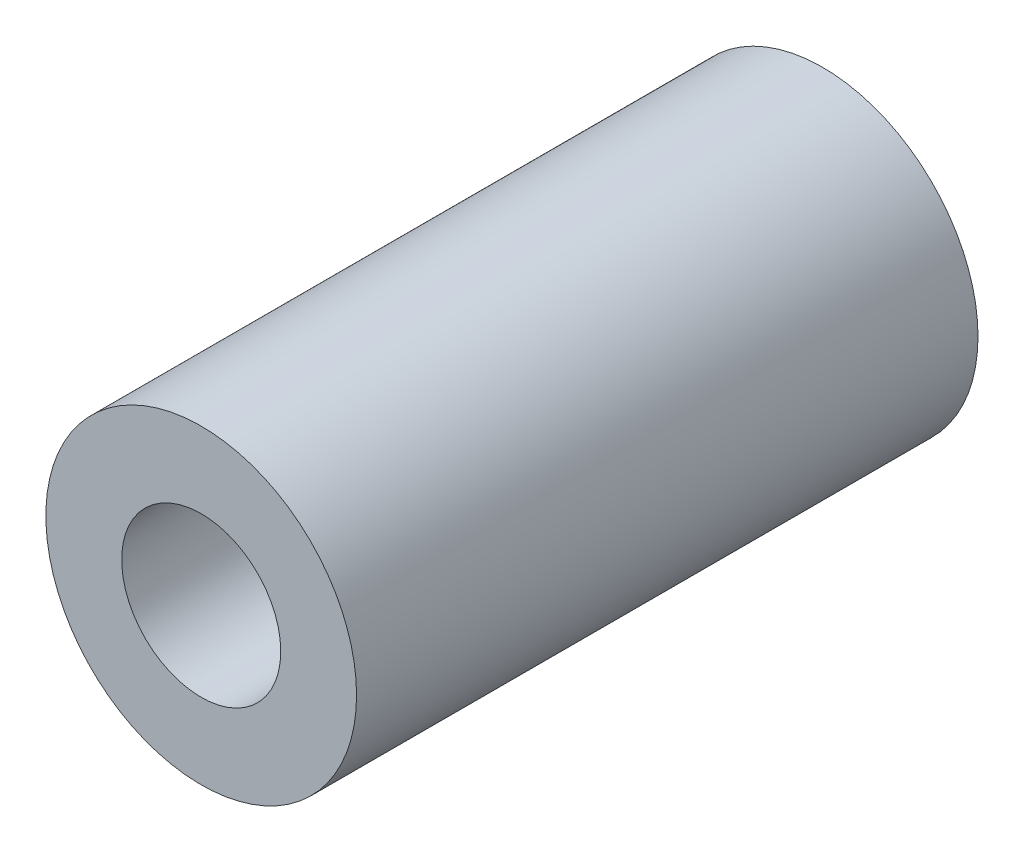
ISO-10303-21;
HEADER;
FILE_DESCRIPTION(('STEP AP214'),'2;1');
FILE_NAME('part.step','',(''),(''),'','','');
FILE_SCHEMA(('AUTOMOTIVE_DESIGN { 1 0 10303 214 1 1 1 1 }'));
ENDSEC;
DATA;
#1=APPLICATION_CONTEXT('core data for automotive mechanical design processes');
#2=APPLICATION_PROTOCOL_DEFINITION('international standard','automotive_design',2000,#1);
#3=PRODUCT_CONTEXT('',#1,'mechanical');
#4=PRODUCT('Part','Part','',(#3));
#5=PRODUCT_RELATED_PRODUCT_CATEGORY('part','',(#4));
#6=PRODUCT_DEFINITION_FORMATION('','',#4);
#7=PRODUCT_DEFINITION_CONTEXT('part definition',#1,'design');
#8=PRODUCT_DEFINITION('design','',#6,#7);
#9=PRODUCT_DEFINITION_SHAPE('','',#8);
#10=(LENGTH_UNIT() NAMED_UNIT(*) SI_UNIT(.MILLI.,.METRE.));
#11=(NAMED_UNIT(*) PLANE_ANGLE_UNIT() SI_UNIT($,.RADIAN.));
#12=(NAMED_UNIT(*) SI_UNIT($,.STERADIAN.) SOLID_ANGLE_UNIT());
#13=UNCERTAINTY_MEASURE_WITH_UNIT(LENGTH_MEASURE(1.E-05),#10,'distance_accuracy_value','');
#14=(GEOMETRIC_REPRESENTATION_CONTEXT(3) GLOBAL_UNCERTAINTY_ASSIGNED_CONTEXT((#13)) GLOBAL_UNIT_ASSIGNED_CONTEXT((#10,
#11,#12)) REPRESENTATION_CONTEXT('',''));
#15=CARTESIAN_POINT('',(0.,0.,0.));
#16=DIRECTION('',(0.,0.,1.));
#17=DIRECTION('',(1.,0.,0.));
#18=AXIS2_PLACEMENT_3D('',#15,#16,#17);
#19=CARTESIAN_POINT('',(0.,0.,9.525));
#20=DIRECTION('',(0.,0.,1.));
#21=DIRECTION('',(1.,0.,0.));
#22=AXIS2_PLACEMENT_3D('',#19,#20,#21);
#23=PLANE('',#22);
#24=CARTESIAN_POINT('',(0.,0.,9.525));
#25=DIRECTION('',(0.,0.,1.));
#26=DIRECTION('',(1.,0.,0.));
#27=AXIS2_PLACEMENT_3D('',#24,#25,#26);
#28=CIRCLE('',#27,4.7625);
#29=CARTESIAN_POINT('',(4.7625,0.,9.525));
#30=VERTEX_POINT('',#29);
#31=EDGE_CURVE('E10',#30,#30,#28,.T.);
#32=ORIENTED_EDGE('',*,*,#31,.T.);
#33=EDGE_LOOP('',(#32));
#34=FACE_BOUND('',#33,.T.);
#35=CARTESIAN_POINT('',(0.,0.,9.525));
#36=DIRECTION('',(0.,0.,1.));
#37=DIRECTION('',(1.,0.,0.));
#38=AXIS2_PLACEMENT_3D('',#35,#36,#37);
#39=CIRCLE('',#38,2.4384);
#40=CARTESIAN_POINT('',(2.4384,0.,9.525));
#41=VERTEX_POINT('',#40);
#42=EDGE_CURVE('E43',#41,#41,#39,.T.);
#43=ORIENTED_EDGE('',*,*,#42,.F.);
#44=EDGE_LOOP('',(#43));
#45=FACE_BOUND('',#44,.T.);
#46=ADVANCED_FACE('F32',(#34,#45),#23,.T.);
#47=CARTESIAN_POINT('',(0.,0.,-9.525));
#48=DIRECTION('',(0.,0.,1.));
#49=DIRECTION('',(1.,0.,0.));
#50=AXIS2_PLACEMENT_3D('',#47,#48,#49);
#51=PLANE('',#50);
#52=CARTESIAN_POINT('',(0.,0.,-9.525));
#53=DIRECTION('',(0.,0.,1.));
#54=DIRECTION('',(1.,0.,0.));
#55=AXIS2_PLACEMENT_3D('',#52,#53,#54);
#56=CIRCLE('',#55,4.7625);
#57=CARTESIAN_POINT('',(4.7625,0.,-9.525));
#58=VERTEX_POINT('',#57);
#59=EDGE_CURVE('E36',#58,#58,#56,.T.);
#60=ORIENTED_EDGE('',*,*,#59,.F.);
#61=EDGE_LOOP('',(#60));
#62=FACE_BOUND('',#61,.T.);
#63=CARTESIAN_POINT('',(0.,0.,-9.525));
#64=DIRECTION('',(0.,0.,1.));
#65=DIRECTION('',(1.,0.,0.));
#66=AXIS2_PLACEMENT_3D('',#63,#64,#65);
#67=CIRCLE('',#66,2.4384);
#68=CARTESIAN_POINT('',(2.4384,0.,-9.525));
#69=VERTEX_POINT('',#68);
#70=EDGE_CURVE('E45',#69,#69,#67,.T.);
#71=ORIENTED_EDGE('',*,*,#70,.T.);
#72=EDGE_LOOP('',(#71));
#73=FACE_BOUND('',#72,.T.);
#74=ADVANCED_FACE('F55',(#62,#73),#51,.F.);
#75=CARTESIAN_POINT('',(0.,0.,9.525));
#76=DIRECTION('',(0.,0.,-1.));
#77=DIRECTION('',(-1.,0.,0.));
#78=AXIS2_PLACEMENT_3D('',#75,#76,#77);
#79=CYLINDRICAL_SURFACE('',#78,4.7625);
#80=ORIENTED_EDGE('',*,*,#31,.F.);
#81=EDGE_LOOP('',(#80));
#82=FACE_BOUND('',#81,.T.);
#83=ORIENTED_EDGE('',*,*,#59,.T.);
#84=EDGE_LOOP('',(#83));
#85=FACE_BOUND('',#84,.T.);
#86=ADVANCED_FACE('F34',(#82,#85),#79,.T.);
#87=CARTESIAN_POINT('',(0.,0.,9.525));
#88=DIRECTION('',(0.,0.,-1.));
#89=DIRECTION('',(-1.,0.,0.));
#90=AXIS2_PLACEMENT_3D('',#87,#88,#89);
#91=CYLINDRICAL_SURFACE('',#90,2.4384);
#92=ORIENTED_EDGE('',*,*,#42,.T.);
#93=EDGE_LOOP('',(#92));
#94=FACE_BOUND('',#93,.T.);
#95=ORIENTED_EDGE('',*,*,#70,.F.);
#96=EDGE_LOOP('',(#95));
#97=FACE_BOUND('',#96,.T.);
#98=ADVANCED_FACE('F51',(#94,#97),#91,.F.);
#99=CLOSED_SHELL('',(#46,#74,#86,#98));
#100=MANIFOLD_SOLID_BREP('B2',#99);
#101=ADVANCED_BREP_SHAPE_REPRESENTATION('',(#18,#100),#14);
#102=SHAPE_DEFINITION_REPRESENTATION(#9,#101);
ENDSEC;
END-ISO-10303-21;
